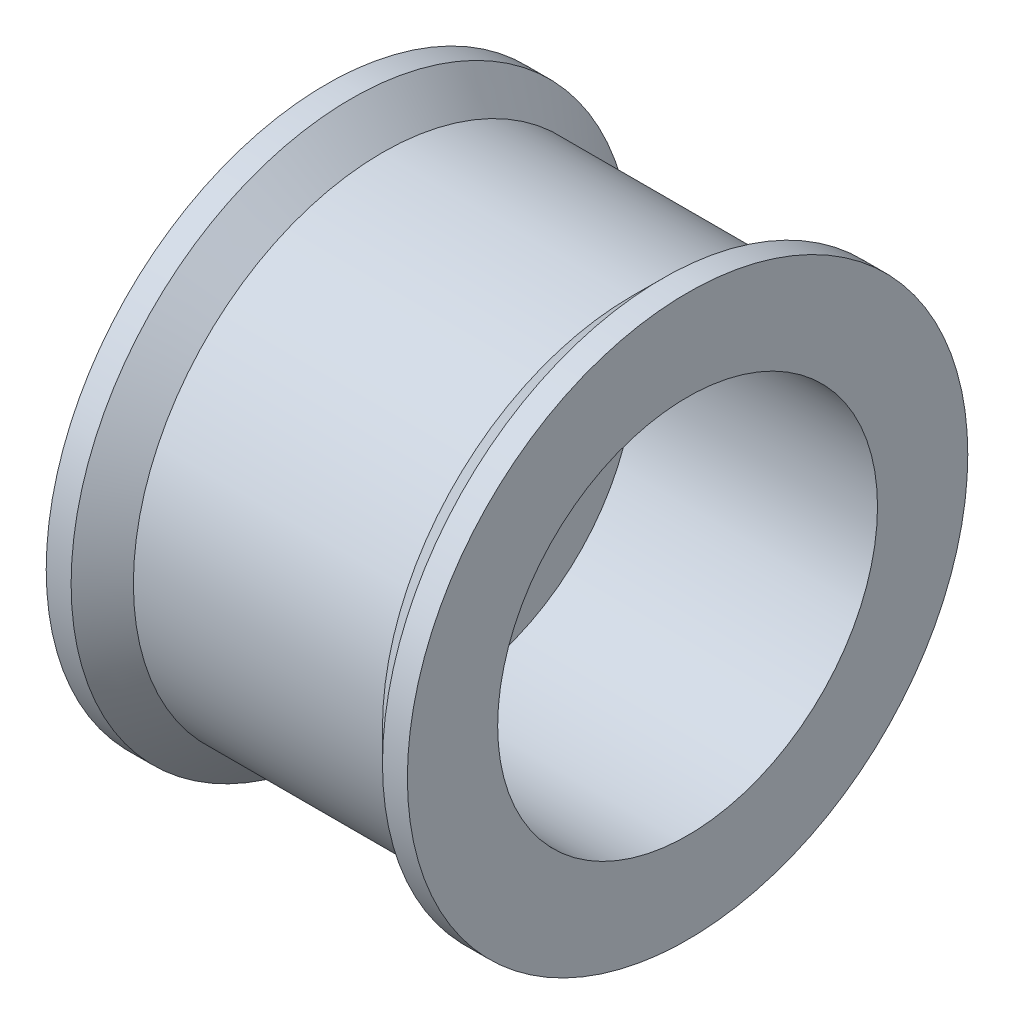
ISO-10303-21;
HEADER;
FILE_DESCRIPTION(('STEP AP214'),'2;1');
FILE_NAME('part.step','',(''),(''),'','','');
FILE_SCHEMA(('AUTOMOTIVE_DESIGN { 1 0 10303 214 1 1 1 1 }'));
ENDSEC;
DATA;
#1=APPLICATION_CONTEXT('core data for automotive mechanical design processes');
#2=APPLICATION_PROTOCOL_DEFINITION('international standard','automotive_design',2000,#1);
#3=PRODUCT_CONTEXT('',#1,'mechanical');
#4=PRODUCT('Part','Part','',(#3));
#5=PRODUCT_RELATED_PRODUCT_CATEGORY('part','',(#4));
#6=PRODUCT_DEFINITION_FORMATION('','',#4);
#7=PRODUCT_DEFINITION_CONTEXT('part definition',#1,'design');
#8=PRODUCT_DEFINITION('design','',#6,#7);
#9=PRODUCT_DEFINITION_SHAPE('','',#8);
#10=(LENGTH_UNIT() NAMED_UNIT(*) SI_UNIT(.MILLI.,.METRE.));
#11=(NAMED_UNIT(*) PLANE_ANGLE_UNIT() SI_UNIT($,.RADIAN.));
#12=(NAMED_UNIT(*) SI_UNIT($,.STERADIAN.) SOLID_ANGLE_UNIT());
#13=UNCERTAINTY_MEASURE_WITH_UNIT(LENGTH_MEASURE(1.E-05),#10,'distance_accuracy_value','');
#14=(GEOMETRIC_REPRESENTATION_CONTEXT(3) GLOBAL_UNCERTAINTY_ASSIGNED_CONTEXT((#13)) GLOBAL_UNIT_ASSIGNED_CONTEXT((#10,
#11,#12)) REPRESENTATION_CONTEXT('',''));
#15=CARTESIAN_POINT('',(0.,0.,0.));
#16=DIRECTION('',(0.,0.,1.));
#17=DIRECTION('',(1.,0.,0.));
#18=AXIS2_PLACEMENT_3D('',#15,#16,#17);
#19=CARTESIAN_POINT('',(0.,0.,0.));
#20=DIRECTION('',(-1.,0.,0.));
#21=DIRECTION('',(0.,0.,1.));
#22=AXIS2_PLACEMENT_3D('',#19,#20,#21);
#23=CYLINDRICAL_SURFACE('',#22,1.5);
#24=CARTESIAN_POINT('',(-2.89999999999999,0.,0.));
#25=DIRECTION('',(-1.,0.,0.));
#26=DIRECTION('',(0.,0.,1.));
#27=AXIS2_PLACEMENT_3D('',#24,#25,#26);
#28=CIRCLE('',#27,1.5);
#29=CARTESIAN_POINT('',(-2.89999999999999,0.,1.5));
#30=VERTEX_POINT('',#29);
#31=EDGE_CURVE('E10',#30,#30,#28,.T.);
#32=ORIENTED_EDGE('',*,*,#31,.T.);
#33=EDGE_LOOP('',(#32));
#34=FACE_BOUND('',#33,.T.);
#35=CARTESIAN_POINT('',(-1.,0.,0.));
#36=DIRECTION('',(1.,0.,0.));
#37=DIRECTION('',(0.,0.,-1.));
#38=AXIS2_PLACEMENT_3D('',#35,#36,#37);
#39=CIRCLE('',#38,1.5);
#40=CARTESIAN_POINT('',(-1.,0.,-1.5));
#41=VERTEX_POINT('',#40);
#42=EDGE_CURVE('E34',#41,#41,#39,.F.);
#43=ORIENTED_EDGE('',*,*,#42,.F.);
#44=EDGE_LOOP('',(#43));
#45=FACE_BOUND('',#44,.T.);
#46=ADVANCED_FACE('F31',(#34,#45),#23,.F.);
#47=CARTESIAN_POINT('',(-2.89999999999999,1.5,0.));
#48=DIRECTION('',(1.,0.,0.));
#49=DIRECTION('',(0.,0.,-1.));
#50=AXIS2_PLACEMENT_3D('',#47,#48,#49);
#51=PLANE('',#50);
#52=ORIENTED_EDGE('',*,*,#31,.F.);
#53=EDGE_LOOP('',(#52));
#54=FACE_BOUND('',#53,.T.);
#55=CARTESIAN_POINT('',(-2.89999999999999,0.,0.));
#56=DIRECTION('',(-1.,0.,0.));
#57=DIRECTION('',(0.,0.,1.));
#58=AXIS2_PLACEMENT_3D('',#55,#56,#57);
#59=CIRCLE('',#58,4.5);
#60=CARTESIAN_POINT('',(-2.89999999999999,0.,4.5));
#61=VERTEX_POINT('',#60);
#62=EDGE_CURVE('E38',#61,#61,#59,.T.);
#63=ORIENTED_EDGE('',*,*,#62,.T.);
#64=EDGE_LOOP('',(#63));
#65=FACE_BOUND('',#64,.T.);
#66=ADVANCED_FACE('F108',(#54,#65),#51,.F.);
#67=CARTESIAN_POINT('',(0.,0.,0.));
#68=DIRECTION('',(-1.,0.,0.));
#69=DIRECTION('',(0.,0.,1.));
#70=AXIS2_PLACEMENT_3D('',#67,#68,#69);
#71=CYLINDRICAL_SURFACE('',#70,4.5);
#72=ORIENTED_EDGE('',*,*,#62,.F.);
#73=EDGE_LOOP('',(#72));
#74=FACE_BOUND('',#73,.T.);
#75=CARTESIAN_POINT('',(-2.50000000000001,0.,0.));
#76=DIRECTION('',(-1.,0.,0.));
#77=DIRECTION('',(0.,0.,1.));
#78=AXIS2_PLACEMENT_3D('',#75,#76,#77);
#79=CIRCLE('',#78,4.5);
#80=CARTESIAN_POINT('',(-2.50000000000001,0.,4.5));
#81=VERTEX_POINT('',#80);
#82=EDGE_CURVE('E43',#81,#81,#79,.T.);
#83=ORIENTED_EDGE('',*,*,#82,.T.);
#84=EDGE_LOOP('',(#83));
#85=FACE_BOUND('',#84,.T.);
#86=ADVANCED_FACE('F71',(#74,#85),#71,.T.);
#87=CARTESIAN_POINT('',(-2.,0.,0.));
#88=DIRECTION('',(-1.,0.,0.));
#89=DIRECTION('',(0.,0.,1.));
#90=AXIS2_PLACEMENT_3D('',#87,#88,#89);
#91=CONICAL_SURFACE('',#90,4.,0.785398163397439);
#92=ORIENTED_EDGE('',*,*,#82,.F.);
#93=EDGE_LOOP('',(#92));
#94=FACE_BOUND('',#93,.T.);
#95=CARTESIAN_POINT('',(-2.,0.,0.));
#96=DIRECTION('',(-1.,0.,0.));
#97=DIRECTION('',(0.,0.,1.));
#98=AXIS2_PLACEMENT_3D('',#95,#96,#97);
#99=CIRCLE('',#98,4.);
#100=CARTESIAN_POINT('',(-2.,0.,4.));
#101=VERTEX_POINT('',#100);
#102=EDGE_CURVE('E66',#101,#101,#99,.T.);
#103=ORIENTED_EDGE('',*,*,#102,.T.);
#104=EDGE_LOOP('',(#103));
#105=FACE_BOUND('',#104,.T.);
#106=ADVANCED_FACE('F73',(#94,#105),#91,.T.);
#107=CARTESIAN_POINT('',(0.,0.,0.));
#108=DIRECTION('',(-1.,0.,0.));
#109=DIRECTION('',(0.,0.,1.));
#110=AXIS2_PLACEMENT_3D('',#107,#108,#109);
#111=CYLINDRICAL_SURFACE('',#110,4.);
#112=ORIENTED_EDGE('',*,*,#102,.F.);
#113=EDGE_LOOP('',(#112));
#114=FACE_BOUND('',#113,.T.);
#115=CARTESIAN_POINT('',(2.,0.,0.));
#116=DIRECTION('',(-1.,0.,0.));
#117=DIRECTION('',(0.,0.,1.));
#118=AXIS2_PLACEMENT_3D('',#115,#116,#117);
#119=CIRCLE('',#118,4.);
#120=CARTESIAN_POINT('',(2.,0.,4.));
#121=VERTEX_POINT('',#120);
#122=EDGE_CURVE('E63',#121,#121,#119,.T.);
#123=ORIENTED_EDGE('',*,*,#122,.T.);
#124=EDGE_LOOP('',(#123));
#125=FACE_BOUND('',#124,.T.);
#126=ADVANCED_FACE('F76',(#114,#125),#111,.T.);
#127=CARTESIAN_POINT('',(2.49999999999999,0.,0.));
#128=DIRECTION('',(1.,0.,0.));
#129=DIRECTION('',(0.,0.,-1.));
#130=AXIS2_PLACEMENT_3D('',#127,#128,#129);
#131=CONICAL_SURFACE('',#130,4.5,0.785398163397457);
#132=ORIENTED_EDGE('',*,*,#122,.F.);
#133=EDGE_LOOP('',(#132));
#134=FACE_BOUND('',#133,.T.);
#135=CARTESIAN_POINT('',(2.49999999999999,0.,0.));
#136=DIRECTION('',(-1.,0.,0.));
#137=DIRECTION('',(0.,0.,1.));
#138=AXIS2_PLACEMENT_3D('',#135,#136,#137);
#139=CIRCLE('',#138,4.5);
#140=CARTESIAN_POINT('',(2.49999999999999,0.,4.5));
#141=VERTEX_POINT('',#140);
#142=EDGE_CURVE('E60',#141,#141,#139,.T.);
#143=ORIENTED_EDGE('',*,*,#142,.T.);
#144=EDGE_LOOP('',(#143));
#145=FACE_BOUND('',#144,.T.);
#146=ADVANCED_FACE('F82',(#134,#145),#131,.T.);
#147=CARTESIAN_POINT('',(0.,0.,0.));
#148=DIRECTION('',(-1.,0.,0.));
#149=DIRECTION('',(0.,0.,1.));
#150=AXIS2_PLACEMENT_3D('',#147,#148,#149);
#151=CYLINDRICAL_SURFACE('',#150,4.5);
#152=ORIENTED_EDGE('',*,*,#142,.F.);
#153=EDGE_LOOP('',(#152));
#154=FACE_BOUND('',#153,.T.);
#155=CARTESIAN_POINT('',(2.89999999999999,0.,0.));
#156=DIRECTION('',(-1.,0.,0.));
#157=DIRECTION('',(0.,0.,1.));
#158=AXIS2_PLACEMENT_3D('',#155,#156,#157);
#159=CIRCLE('',#158,4.5);
#160=CARTESIAN_POINT('',(2.89999999999999,0.,4.5));
#161=VERTEX_POINT('',#160);
#162=EDGE_CURVE('E52',#161,#161,#159,.T.);
#163=ORIENTED_EDGE('',*,*,#162,.T.);
#164=EDGE_LOOP('',(#163));
#165=FACE_BOUND('',#164,.T.);
#166=ADVANCED_FACE('F88',(#154,#165),#151,.T.);
#167=CARTESIAN_POINT('',(2.89999999999999,4.5,0.));
#168=DIRECTION('',(-1.,0.,0.));
#169=DIRECTION('',(0.,0.,1.));
#170=AXIS2_PLACEMENT_3D('',#167,#168,#169);
#171=PLANE('',#170);
#172=CARTESIAN_POINT('',(2.89999999999999,0.,0.));
#173=DIRECTION('',(-1.,0.,0.));
#174=DIRECTION('',(0.,0.,1.));
#175=AXIS2_PLACEMENT_3D('',#172,#173,#174);
#176=CIRCLE('',#175,3.05);
#177=CARTESIAN_POINT('',(2.89999999999999,0.,3.05));
#178=VERTEX_POINT('',#177);
#179=EDGE_CURVE('E46',#178,#178,#176,.T.);
#180=ORIENTED_EDGE('',*,*,#179,.T.);
#181=EDGE_LOOP('',(#180));
#182=FACE_BOUND('',#181,.T.);
#183=ORIENTED_EDGE('',*,*,#162,.F.);
#184=EDGE_LOOP('',(#183));
#185=FACE_BOUND('',#184,.T.);
#186=ADVANCED_FACE('F94',(#182,#185),#171,.F.);
#187=CARTESIAN_POINT('',(-1.,0.,0.));
#188=DIRECTION('',(1.,0.,0.));
#189=DIRECTION('',(0.,0.,-1.));
#190=AXIS2_PLACEMENT_3D('',#187,#188,#189);
#191=PLANE('',#190);
#192=CARTESIAN_POINT('',(-1.,0.,0.));
#193=DIRECTION('',(1.,0.,0.));
#194=DIRECTION('',(0.,0.,-1.));
#195=AXIS2_PLACEMENT_3D('',#192,#193,#194);
#196=CIRCLE('',#195,3.05);
#197=CARTESIAN_POINT('',(-1.,0.,-3.05));
#198=VERTEX_POINT('',#197);
#199=EDGE_CURVE('E48',#198,#198,#196,.T.);
#200=ORIENTED_EDGE('',*,*,#199,.T.);
#201=EDGE_LOOP('',(#200));
#202=FACE_BOUND('',#201,.T.);
#203=ORIENTED_EDGE('',*,*,#42,.T.);
#204=EDGE_LOOP('',(#203));
#205=FACE_BOUND('',#204,.T.);
#206=ADVANCED_FACE('F99',(#202,#205),#191,.T.);
#207=CARTESIAN_POINT('',(-1.,0.,0.));
#208=DIRECTION('',(1.,0.,0.));
#209=DIRECTION('',(0.,0.,-1.));
#210=AXIS2_PLACEMENT_3D('',#207,#208,#209);
#211=CYLINDRICAL_SURFACE('',#210,3.05);
#212=ORIENTED_EDGE('',*,*,#199,.F.);
#213=EDGE_LOOP('',(#212));
#214=FACE_BOUND('',#213,.T.);
#215=ORIENTED_EDGE('',*,*,#179,.F.);
#216=EDGE_LOOP('',(#215));
#217=FACE_BOUND('',#216,.T.);
#218=ADVANCED_FACE('F104',(#214,#217),#211,.F.);
#219=CLOSED_SHELL('',(#46,#66,#86,#106,#126,#146,#166,#186,#206,#218));
#220=MANIFOLD_SOLID_BREP('B2',#219);
#221=ADVANCED_BREP_SHAPE_REPRESENTATION('',(#18,#220),#14);
#222=SHAPE_DEFINITION_REPRESENTATION(#9,#221);
ENDSEC;
END-ISO-10303-21;
